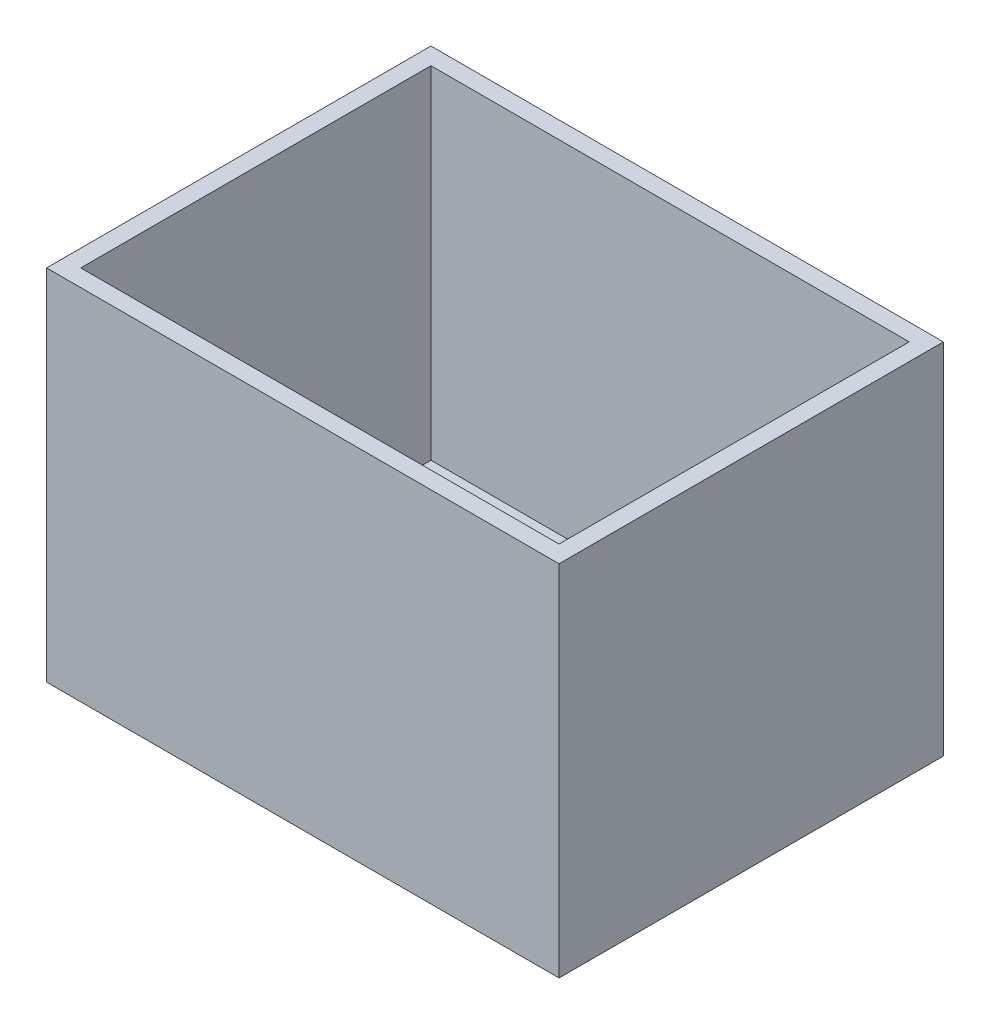
ISO-10303-21;
HEADER;
FILE_DESCRIPTION(('STEP AP214'),'2;1');
FILE_NAME('part.step','',(''),(''),'','','');
FILE_SCHEMA(('AUTOMOTIVE_DESIGN { 1 0 10303 214 1 1 1 1 }'));
ENDSEC;
DATA;
#1=APPLICATION_CONTEXT('core data for automotive mechanical design processes');
#2=APPLICATION_PROTOCOL_DEFINITION('international standard','automotive_design',2000,#1);
#3=PRODUCT_CONTEXT('',#1,'mechanical');
#4=PRODUCT('Part','Part','',(#3));
#5=PRODUCT_RELATED_PRODUCT_CATEGORY('part','',(#4));
#6=PRODUCT_DEFINITION_FORMATION('','',#4);
#7=PRODUCT_DEFINITION_CONTEXT('part definition',#1,'design');
#8=PRODUCT_DEFINITION('design','',#6,#7);
#9=PRODUCT_DEFINITION_SHAPE('','',#8);
#10=(LENGTH_UNIT() NAMED_UNIT(*) SI_UNIT(.MILLI.,.METRE.));
#11=(NAMED_UNIT(*) PLANE_ANGLE_UNIT() SI_UNIT($,.RADIAN.));
#12=(NAMED_UNIT(*) SI_UNIT($,.STERADIAN.) SOLID_ANGLE_UNIT());
#13=UNCERTAINTY_MEASURE_WITH_UNIT(LENGTH_MEASURE(1.E-05),#10,'distance_accuracy_value','');
#14=(GEOMETRIC_REPRESENTATION_CONTEXT(3) GLOBAL_UNCERTAINTY_ASSIGNED_CONTEXT((#13)) GLOBAL_UNIT_ASSIGNED_CONTEXT((#10,
#11,#12)) REPRESENTATION_CONTEXT('',''));
#15=CARTESIAN_POINT('',(0.,0.,0.));
#16=DIRECTION('',(0.,0.,1.));
#17=DIRECTION('',(1.,0.,0.));
#18=AXIS2_PLACEMENT_3D('',#15,#16,#17);
#19=CARTESIAN_POINT('',(0.,400.,0.));
#20=DIRECTION('',(0.,1.,0.));
#21=DIRECTION('',(0.,0.,1.));
#22=AXIS2_PLACEMENT_3D('',#19,#20,#21);
#23=PLANE('',#22);
#24=DIRECTION('',(1.,0.,0.));
#25=VECTOR('',#24,1.);
#26=CARTESIAN_POINT('',(-300.,400.,225.));
#27=LINE('',#26,#25);
#28=CARTESIAN_POINT('',(-300.,400.,225.));
#29=VERTEX_POINT('',#28);
#30=CARTESIAN_POINT('',(300.,400.,225.));
#31=VERTEX_POINT('',#30);
#32=EDGE_CURVE('E150',#29,#31,#27,.T.);
#33=ORIENTED_EDGE('',*,*,#32,.T.);
#34=DIRECTION('',(0.,0.,-1.));
#35=VECTOR('',#34,1.);
#36=CARTESIAN_POINT('',(300.,400.,225.));
#37=LINE('',#36,#35);
#38=CARTESIAN_POINT('',(300.,400.,-225.));
#39=VERTEX_POINT('',#38);
#40=EDGE_CURVE('E103',#31,#39,#37,.T.);
#41=ORIENTED_EDGE('',*,*,#40,.T.);
#42=DIRECTION('',(-1.,0.,0.));
#43=VECTOR('',#42,1.);
#44=CARTESIAN_POINT('',(-300.,400.,-225.));
#45=LINE('',#44,#43);
#46=CARTESIAN_POINT('',(-300.,400.,-225.));
#47=VERTEX_POINT('',#46);
#48=EDGE_CURVE('E153',#39,#47,#45,.T.);
#49=ORIENTED_EDGE('',*,*,#48,.T.);
#50=DIRECTION('',(0.,0.,1.));
#51=VECTOR('',#50,1.);
#52=CARTESIAN_POINT('',(-300.,400.,225.));
#53=LINE('',#52,#51);
#54=EDGE_CURVE('E56',#47,#29,#53,.T.);
#55=ORIENTED_EDGE('',*,*,#54,.T.);
#56=EDGE_LOOP('',(#33,#41,#49,#55));
#57=FACE_BOUND('',#56,.T.);
#58=DIRECTION('',(-1.,0.,0.));
#59=VECTOR('',#58,1.);
#60=CARTESIAN_POINT('',(-280.,400.,-205.));
#61=LINE('',#60,#59);
#62=CARTESIAN_POINT('',(280.,400.,-205.));
#63=VERTEX_POINT('',#62);
#64=CARTESIAN_POINT('',(-280.,400.,-205.));
#65=VERTEX_POINT('',#64);
#66=EDGE_CURVE('E125',#63,#65,#61,.T.);
#67=ORIENTED_EDGE('',*,*,#66,.F.);
#68=DIRECTION('',(0.,0.,-1.));
#69=VECTOR('',#68,1.);
#70=CARTESIAN_POINT('',(280.,400.,205.));
#71=LINE('',#70,#69);
#72=CARTESIAN_POINT('',(280.,400.,205.));
#73=VERTEX_POINT('',#72);
#74=EDGE_CURVE('E123',#73,#63,#71,.T.);
#75=ORIENTED_EDGE('',*,*,#74,.F.);
#76=DIRECTION('',(1.,0.,0.));
#77=VECTOR('',#76,1.);
#78=CARTESIAN_POINT('',(-280.,400.,205.));
#79=LINE('',#78,#77);
#80=CARTESIAN_POINT('',(-280.,400.,205.));
#81=VERTEX_POINT('',#80);
#82=EDGE_CURVE('E130',#81,#73,#79,.T.);
#83=ORIENTED_EDGE('',*,*,#82,.F.);
#84=DIRECTION('',(0.,0.,1.));
#85=VECTOR('',#84,1.);
#86=CARTESIAN_POINT('',(-280.,400.,205.));
#87=LINE('',#86,#85);
#88=EDGE_CURVE('E128',#65,#81,#87,.T.);
#89=ORIENTED_EDGE('',*,*,#88,.F.);
#90=EDGE_LOOP('',(#67,#75,#83,#89));
#91=FACE_BOUND('',#90,.T.);
#92=ADVANCED_FACE('F33',(#57,#91),#23,.T.);
#93=CARTESIAN_POINT('',(-300.,400.,225.));
#94=DIRECTION('',(0.,0.,-1.));
#95=DIRECTION('',(-1.,0.,0.));
#96=AXIS2_PLACEMENT_3D('',#93,#94,#95);
#97=PLANE('',#96);
#98=DIRECTION('',(0.,-1.,0.));
#99=VECTOR('',#98,1.);
#100=CARTESIAN_POINT('',(-300.,400.,225.));
#101=LINE('',#100,#99);
#102=CARTESIAN_POINT('',(-300.,-20.,225.));
#103=VERTEX_POINT('',#102);
#104=EDGE_CURVE('E108',#29,#103,#101,.T.);
#105=ORIENTED_EDGE('',*,*,#104,.T.);
#106=DIRECTION('',(-1.,0.,0.));
#107=VECTOR('',#106,1.);
#108=CARTESIAN_POINT('',(-300.,-20.,225.));
#109=LINE('',#108,#107);
#110=CARTESIAN_POINT('',(300.,-20.,225.));
#111=VERTEX_POINT('',#110);
#112=EDGE_CURVE('E107',#111,#103,#109,.T.);
#113=ORIENTED_EDGE('',*,*,#112,.F.);
#114=DIRECTION('',(0.,-1.,0.));
#115=VECTOR('',#114,1.);
#116=CARTESIAN_POINT('',(300.,400.,225.));
#117=LINE('',#116,#115);
#118=EDGE_CURVE('E11',#31,#111,#117,.T.);
#119=ORIENTED_EDGE('',*,*,#118,.F.);
#120=ORIENTED_EDGE('',*,*,#32,.F.);
#121=EDGE_LOOP('',(#105,#113,#119,#120));
#122=FACE_BOUND('',#121,.T.);
#123=ADVANCED_FACE('F35',(#122),#97,.F.);
#124=CARTESIAN_POINT('',(300.,400.,225.));
#125=DIRECTION('',(-1.,0.,0.));
#126=DIRECTION('',(0.,0.,1.));
#127=AXIS2_PLACEMENT_3D('',#124,#125,#126);
#128=PLANE('',#127);
#129=ORIENTED_EDGE('',*,*,#118,.T.);
#130=DIRECTION('',(0.,0.,1.));
#131=VECTOR('',#130,1.);
#132=CARTESIAN_POINT('',(300.,-20.,-225.));
#133=LINE('',#132,#131);
#134=CARTESIAN_POINT('',(300.,-20.,-225.));
#135=VERTEX_POINT('',#134);
#136=EDGE_CURVE('E102',#135,#111,#133,.T.);
#137=ORIENTED_EDGE('',*,*,#136,.F.);
#138=DIRECTION('',(0.,-1.,0.));
#139=VECTOR('',#138,1.);
#140=CARTESIAN_POINT('',(300.,400.,-225.));
#141=LINE('',#140,#139);
#142=EDGE_CURVE('E41',#39,#135,#141,.T.);
#143=ORIENTED_EDGE('',*,*,#142,.F.);
#144=ORIENTED_EDGE('',*,*,#40,.F.);
#145=EDGE_LOOP('',(#129,#137,#143,#144));
#146=FACE_BOUND('',#145,.T.);
#147=ADVANCED_FACE('F99',(#146),#128,.F.);
#148=CARTESIAN_POINT('',(-300.,400.,-225.));
#149=DIRECTION('',(0.,0.,1.));
#150=DIRECTION('',(1.,0.,0.));
#151=AXIS2_PLACEMENT_3D('',#148,#149,#150);
#152=PLANE('',#151);
#153=ORIENTED_EDGE('',*,*,#142,.T.);
#154=DIRECTION('',(1.,0.,0.));
#155=VECTOR('',#154,1.);
#156=CARTESIAN_POINT('',(-300.,-20.,-225.));
#157=LINE('',#156,#155);
#158=CARTESIAN_POINT('',(-300.,-20.,-225.));
#159=VERTEX_POINT('',#158);
#160=EDGE_CURVE('E117',#159,#135,#157,.T.);
#161=ORIENTED_EDGE('',*,*,#160,.F.);
#162=DIRECTION('',(0.,-1.,0.));
#163=VECTOR('',#162,1.);
#164=CARTESIAN_POINT('',(-300.,400.,-225.));
#165=LINE('',#164,#163);
#166=EDGE_CURVE('E157',#47,#159,#165,.T.);
#167=ORIENTED_EDGE('',*,*,#166,.F.);
#168=ORIENTED_EDGE('',*,*,#48,.F.);
#169=EDGE_LOOP('',(#153,#161,#167,#168));
#170=FACE_BOUND('',#169,.T.);
#171=ADVANCED_FACE('F160',(#170),#152,.F.);
#172=CARTESIAN_POINT('',(-300.,400.,225.));
#173=DIRECTION('',(1.,0.,0.));
#174=DIRECTION('',(0.,0.,-1.));
#175=AXIS2_PLACEMENT_3D('',#172,#173,#174);
#176=PLANE('',#175);
#177=ORIENTED_EDGE('',*,*,#166,.T.);
#178=DIRECTION('',(0.,0.,-1.));
#179=VECTOR('',#178,1.);
#180=CARTESIAN_POINT('',(-300.,-20.,-225.));
#181=LINE('',#180,#179);
#182=EDGE_CURVE('E112',#103,#159,#181,.T.);
#183=ORIENTED_EDGE('',*,*,#182,.F.);
#184=ORIENTED_EDGE('',*,*,#104,.F.);
#185=ORIENTED_EDGE('',*,*,#54,.F.);
#186=EDGE_LOOP('',(#177,#183,#184,#185));
#187=FACE_BOUND('',#186,.T.);
#188=ADVANCED_FACE('F196',(#187),#176,.F.);
#189=CARTESIAN_POINT('',(280.,400.,205.));
#190=DIRECTION('',(-1.,0.,0.));
#191=DIRECTION('',(0.,0.,1.));
#192=AXIS2_PLACEMENT_3D('',#189,#190,#191);
#193=PLANE('',#192);
#194=DIRECTION('',(0.,0.,-1.));
#195=VECTOR('',#194,1.);
#196=CARTESIAN_POINT('',(280.,0.,205.));
#197=LINE('',#196,#195);
#198=CARTESIAN_POINT('',(280.,0.,205.));
#199=VERTEX_POINT('',#198);
#200=CARTESIAN_POINT('',(280.,0.,-205.));
#201=VERTEX_POINT('',#200);
#202=EDGE_CURVE('E122',#199,#201,#197,.T.);
#203=ORIENTED_EDGE('',*,*,#202,.F.);
#204=DIRECTION('',(0.,-1.,0.));
#205=VECTOR('',#204,1.);
#206=CARTESIAN_POINT('',(280.,400.,205.));
#207=LINE('',#206,#205);
#208=EDGE_CURVE('E132',#73,#199,#207,.T.);
#209=ORIENTED_EDGE('',*,*,#208,.F.);
#210=ORIENTED_EDGE('',*,*,#74,.T.);
#211=DIRECTION('',(0.,-1.,0.));
#212=VECTOR('',#211,1.);
#213=CARTESIAN_POINT('',(280.,400.,-205.));
#214=LINE('',#213,#212);
#215=EDGE_CURVE('E147',#63,#201,#214,.T.);
#216=ORIENTED_EDGE('',*,*,#215,.T.);
#217=EDGE_LOOP('',(#203,#209,#210,#216));
#218=FACE_BOUND('',#217,.T.);
#219=ADVANCED_FACE('F180',(#218),#193,.T.);
#220=CARTESIAN_POINT('',(-280.,400.,-205.));
#221=DIRECTION('',(0.,0.,1.));
#222=DIRECTION('',(1.,0.,0.));
#223=AXIS2_PLACEMENT_3D('',#220,#221,#222);
#224=PLANE('',#223);
#225=DIRECTION('',(-1.,0.,0.));
#226=VECTOR('',#225,1.);
#227=CARTESIAN_POINT('',(-280.,0.,-205.));
#228=LINE('',#227,#226);
#229=CARTESIAN_POINT('',(-280.,0.,-205.));
#230=VERTEX_POINT('',#229);
#231=EDGE_CURVE('E135',#201,#230,#228,.T.);
#232=ORIENTED_EDGE('',*,*,#231,.F.);
#233=ORIENTED_EDGE('',*,*,#215,.F.);
#234=ORIENTED_EDGE('',*,*,#66,.T.);
#235=DIRECTION('',(0.,-1.,0.));
#236=VECTOR('',#235,1.);
#237=CARTESIAN_POINT('',(-280.,400.,-205.));
#238=LINE('',#237,#236);
#239=EDGE_CURVE('E145',#65,#230,#238,.T.);
#240=ORIENTED_EDGE('',*,*,#239,.T.);
#241=EDGE_LOOP('',(#232,#233,#234,#240));
#242=FACE_BOUND('',#241,.T.);
#243=ADVANCED_FACE('F172',(#242),#224,.T.);
#244=CARTESIAN_POINT('',(-280.,400.,205.));
#245=DIRECTION('',(1.,0.,0.));
#246=DIRECTION('',(0.,0.,-1.));
#247=AXIS2_PLACEMENT_3D('',#244,#245,#246);
#248=PLANE('',#247);
#249=DIRECTION('',(0.,0.,1.));
#250=VECTOR('',#249,1.);
#251=CARTESIAN_POINT('',(-280.,0.,205.));
#252=LINE('',#251,#250);
#253=CARTESIAN_POINT('',(-280.,0.,205.));
#254=VERTEX_POINT('',#253);
#255=EDGE_CURVE('E138',#230,#254,#252,.T.);
#256=ORIENTED_EDGE('',*,*,#255,.F.);
#257=ORIENTED_EDGE('',*,*,#239,.F.);
#258=ORIENTED_EDGE('',*,*,#88,.T.);
#259=DIRECTION('',(0.,-1.,0.));
#260=VECTOR('',#259,1.);
#261=CARTESIAN_POINT('',(-280.,400.,205.));
#262=LINE('',#261,#260);
#263=EDGE_CURVE('E48',#81,#254,#262,.T.);
#264=ORIENTED_EDGE('',*,*,#263,.T.);
#265=EDGE_LOOP('',(#256,#257,#258,#264));
#266=FACE_BOUND('',#265,.T.);
#267=ADVANCED_FACE('F175',(#266),#248,.T.);
#268=CARTESIAN_POINT('',(-280.,400.,205.));
#269=DIRECTION('',(0.,0.,-1.));
#270=DIRECTION('',(-1.,0.,0.));
#271=AXIS2_PLACEMENT_3D('',#268,#269,#270);
#272=PLANE('',#271);
#273=DIRECTION('',(1.,0.,0.));
#274=VECTOR('',#273,1.);
#275=CARTESIAN_POINT('',(-280.,0.,205.));
#276=LINE('',#275,#274);
#277=EDGE_CURVE('E126',#254,#199,#276,.T.);
#278=ORIENTED_EDGE('',*,*,#277,.F.);
#279=ORIENTED_EDGE('',*,*,#263,.F.);
#280=ORIENTED_EDGE('',*,*,#82,.T.);
#281=ORIENTED_EDGE('',*,*,#208,.T.);
#282=EDGE_LOOP('',(#278,#279,#280,#281));
#283=FACE_BOUND('',#282,.T.);
#284=ADVANCED_FACE('F182',(#283),#272,.T.);
#285=CARTESIAN_POINT('',(0.,0.,0.));
#286=DIRECTION('',(0.,1.,0.));
#287=DIRECTION('',(0.,0.,1.));
#288=AXIS2_PLACEMENT_3D('',#285,#286,#287);
#289=PLANE('',#288);
#290=ORIENTED_EDGE('',*,*,#277,.T.);
#291=ORIENTED_EDGE('',*,*,#202,.T.);
#292=ORIENTED_EDGE('',*,*,#231,.T.);
#293=ORIENTED_EDGE('',*,*,#255,.T.);
#294=EDGE_LOOP('',(#290,#291,#292,#293));
#295=FACE_BOUND('',#294,.T.);
#296=ADVANCED_FACE('F177',(#295),#289,.T.);
#297=CARTESIAN_POINT('',(0.,-20.,0.));
#298=DIRECTION('',(0.,1.,0.));
#299=DIRECTION('',(0.,0.,1.));
#300=AXIS2_PLACEMENT_3D('',#297,#298,#299);
#301=PLANE('',#300);
#302=ORIENTED_EDGE('',*,*,#136,.T.);
#303=ORIENTED_EDGE('',*,*,#112,.T.);
#304=ORIENTED_EDGE('',*,*,#182,.T.);
#305=ORIENTED_EDGE('',*,*,#160,.T.);
#306=EDGE_LOOP('',(#302,#303,#304,#305));
#307=FACE_BOUND('',#306,.T.);
#308=ADVANCED_FACE('F115',(#307),#301,.F.);
#309=CLOSED_SHELL('',(#92,#123,#147,#171,#188,#219,#243,#267,#284,#296,#308));
#310=MANIFOLD_SOLID_BREP('B2',#309);
#311=ADVANCED_BREP_SHAPE_REPRESENTATION('',(#18,#310),#14);
#312=SHAPE_DEFINITION_REPRESENTATION(#9,#311);
ENDSEC;
END-ISO-10303-21;
